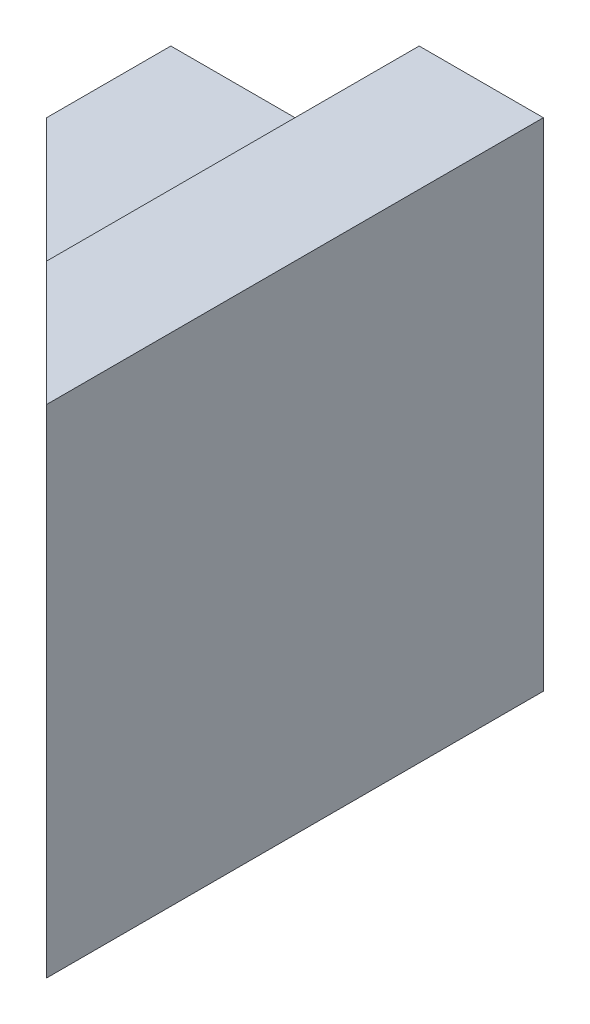
ISO-10303-21;
HEADER;
FILE_DESCRIPTION(('STEP AP214'),'2;1');
FILE_NAME('part.step','',(''),(''),'','','');
FILE_SCHEMA(('AUTOMOTIVE_DESIGN { 1 0 10303 214 1 1 1 1 }'));
ENDSEC;
DATA;
#1=APPLICATION_CONTEXT('core data for automotive mechanical design processes');
#2=APPLICATION_PROTOCOL_DEFINITION('international standard','automotive_design',2000,#1);
#3=PRODUCT_CONTEXT('',#1,'mechanical');
#4=PRODUCT('Part','Part','',(#3));
#5=PRODUCT_RELATED_PRODUCT_CATEGORY('part','',(#4));
#6=PRODUCT_DEFINITION_FORMATION('','',#4);
#7=PRODUCT_DEFINITION_CONTEXT('part definition',#1,'design');
#8=PRODUCT_DEFINITION('design','',#6,#7);
#9=PRODUCT_DEFINITION_SHAPE('','',#8);
#10=(LENGTH_UNIT() NAMED_UNIT(*) SI_UNIT(.MILLI.,.METRE.));
#11=(NAMED_UNIT(*) PLANE_ANGLE_UNIT() SI_UNIT($,.RADIAN.));
#12=(NAMED_UNIT(*) SI_UNIT($,.STERADIAN.) SOLID_ANGLE_UNIT());
#13=UNCERTAINTY_MEASURE_WITH_UNIT(LENGTH_MEASURE(1.E-05),#10,'distance_accuracy_value','');
#14=(GEOMETRIC_REPRESENTATION_CONTEXT(3) GLOBAL_UNCERTAINTY_ASSIGNED_CONTEXT((#13)) GLOBAL_UNIT_ASSIGNED_CONTEXT((#10,
#11,#12)) REPRESENTATION_CONTEXT('',''));
#15=CARTESIAN_POINT('',(0.,0.,0.));
#16=DIRECTION('',(0.,0.,1.));
#17=DIRECTION('',(1.,0.,0.));
#18=AXIS2_PLACEMENT_3D('',#15,#16,#17);
#19=CARTESIAN_POINT('',(1.,0.,4.));
#20=DIRECTION('',(0.,1.,0.));
#21=DIRECTION('',(-1.,0.,0.));
#22=AXIS2_PLACEMENT_3D('',#19,#20,#21);
#23=PLANE('',#22);
#24=DIRECTION('',(0.,0.,-1.));
#25=VECTOR('',#24,1.);
#26=CARTESIAN_POINT('',(1.,0.,4.));
#27=LINE('',#26,#25);
#28=CARTESIAN_POINT('',(1.,0.,1.));
#29=VERTEX_POINT('',#28);
#30=CARTESIAN_POINT('',(1.,0.,0.));
#31=VERTEX_POINT('',#30);
#32=EDGE_CURVE('E11',#29,#31,#27,.T.);
#33=ORIENTED_EDGE('',*,*,#32,.F.);
#34=DIRECTION('',(-0.707106781186548,0.,-0.707106781186548));
#35=VECTOR('',#34,1.);
#36=CARTESIAN_POINT('',(2.5,0.,2.5));
#37=LINE('',#36,#35);
#38=CARTESIAN_POINT('',(0.,0.,0.));
#39=VERTEX_POINT('',#38);
#40=EDGE_CURVE('E225',#29,#39,#37,.T.);
#41=ORIENTED_EDGE('',*,*,#40,.T.);
#42=DIRECTION('',(1.,0.,0.));
#43=VECTOR('',#42,1.);
#44=CARTESIAN_POINT('',(1.,0.,0.));
#45=LINE('',#44,#43);
#46=EDGE_CURVE('E167',#39,#31,#45,.T.);
#47=ORIENTED_EDGE('',*,*,#46,.T.);
#48=EDGE_LOOP('',(#33,#41,#47));
#49=FACE_BOUND('',#48,.T.);
#50=ADVANCED_FACE('F33',(#49),#23,.F.);
#51=CARTESIAN_POINT('',(1.,1.,4.));
#52=DIRECTION('',(-1.,0.,0.));
#53=DIRECTION('',(0.,0.,1.));
#54=AXIS2_PLACEMENT_3D('',#51,#52,#53);
#55=PLANE('',#54);
#56=DIRECTION('',(0.,0.,-1.));
#57=VECTOR('',#56,1.);
#58=CARTESIAN_POINT('',(1.,1.,4.));
#59=LINE('',#58,#57);
#60=CARTESIAN_POINT('',(1.,1.,1.));
#61=VERTEX_POINT('',#60);
#62=CARTESIAN_POINT('',(1.,1.,0.));
#63=VERTEX_POINT('',#62);
#64=EDGE_CURVE('E40',#61,#63,#59,.T.);
#65=ORIENTED_EDGE('',*,*,#64,.F.);
#66=DIRECTION('',(0.,-1.,0.));
#67=VECTOR('',#66,1.);
#68=CARTESIAN_POINT('',(1.,1.,1.));
#69=LINE('',#68,#67);
#70=EDGE_CURVE('E223',#61,#29,#69,.T.);
#71=ORIENTED_EDGE('',*,*,#70,.T.);
#72=ORIENTED_EDGE('',*,*,#32,.T.);
#73=DIRECTION('',(0.,1.,0.));
#74=VECTOR('',#73,1.);
#75=CARTESIAN_POINT('',(1.,1.,0.));
#76=LINE('',#75,#74);
#77=EDGE_CURVE('E161',#31,#63,#76,.T.);
#78=ORIENTED_EDGE('',*,*,#77,.T.);
#79=EDGE_LOOP('',(#65,#71,#72,#78));
#80=FACE_BOUND('',#79,.T.);
#81=ADVANCED_FACE('F162',(#80),#55,.F.);
#82=CARTESIAN_POINT('',(3.,1.,4.));
#83=DIRECTION('',(0.,1.,0.));
#84=DIRECTION('',(-1.,0.,0.));
#85=AXIS2_PLACEMENT_3D('',#82,#83,#84);
#86=PLANE('',#85);
#87=DIRECTION('',(0.,0.,-1.));
#88=VECTOR('',#87,1.);
#89=CARTESIAN_POINT('',(3.,1.,4.));
#90=LINE('',#89,#88);
#91=CARTESIAN_POINT('',(3.,1.,3.));
#92=VERTEX_POINT('',#91);
#93=CARTESIAN_POINT('',(3.,1.,0.));
#94=VERTEX_POINT('',#93);
#95=EDGE_CURVE('E146',#92,#94,#90,.T.);
#96=ORIENTED_EDGE('',*,*,#95,.F.);
#97=DIRECTION('',(-0.707106781186548,0.,-0.707106781186548));
#98=VECTOR('',#97,1.);
#99=CARTESIAN_POINT('',(3.5,1.,3.5));
#100=LINE('',#99,#98);
#101=EDGE_CURVE('E157',#92,#61,#100,.T.);
#102=ORIENTED_EDGE('',*,*,#101,.T.);
#103=ORIENTED_EDGE('',*,*,#64,.T.);
#104=DIRECTION('',(1.,0.,0.));
#105=VECTOR('',#104,1.);
#106=CARTESIAN_POINT('',(3.,1.,0.));
#107=LINE('',#106,#105);
#108=EDGE_CURVE('E155',#63,#94,#107,.T.);
#109=ORIENTED_EDGE('',*,*,#108,.T.);
#110=EDGE_LOOP('',(#96,#102,#103,#109));
#111=FACE_BOUND('',#110,.T.);
#112=ADVANCED_FACE('F153',(#111),#86,.F.);
#113=CARTESIAN_POINT('',(3.,0.,4.));
#114=DIRECTION('',(1.,0.,0.));
#115=DIRECTION('',(0.,0.,-1.));
#116=AXIS2_PLACEMENT_3D('',#113,#114,#115);
#117=PLANE('',#116);
#118=DIRECTION('',(0.,0.,-1.));
#119=VECTOR('',#118,1.);
#120=CARTESIAN_POINT('',(3.,0.,4.));
#121=LINE('',#120,#119);
#122=CARTESIAN_POINT('',(3.,0.,3.));
#123=VERTEX_POINT('',#122);
#124=CARTESIAN_POINT('',(3.,0.,0.));
#125=VERTEX_POINT('',#124);
#126=EDGE_CURVE('E139',#123,#125,#121,.T.);
#127=ORIENTED_EDGE('',*,*,#126,.F.);
#128=DIRECTION('',(0.,1.,0.));
#129=VECTOR('',#128,1.);
#130=CARTESIAN_POINT('',(3.,0.,3.));
#131=LINE('',#130,#129);
#132=EDGE_CURVE('E219',#123,#92,#131,.T.);
#133=ORIENTED_EDGE('',*,*,#132,.T.);
#134=ORIENTED_EDGE('',*,*,#95,.T.);
#135=DIRECTION('',(0.,-1.,0.));
#136=VECTOR('',#135,1.);
#137=CARTESIAN_POINT('',(3.,0.,0.));
#138=LINE('',#137,#136);
#139=EDGE_CURVE('E172',#94,#125,#138,.T.);
#140=ORIENTED_EDGE('',*,*,#139,.T.);
#141=EDGE_LOOP('',(#127,#133,#134,#140));
#142=FACE_BOUND('',#141,.T.);
#143=ADVANCED_FACE('F230',(#142),#117,.F.);
#144=CARTESIAN_POINT('',(4.,0.,4.));
#145=DIRECTION('',(0.,1.,0.));
#146=DIRECTION('',(-1.,0.,0.));
#147=AXIS2_PLACEMENT_3D('',#144,#145,#146);
#148=PLANE('',#147);
#149=DIRECTION('',(0.,0.,-1.));
#150=VECTOR('',#149,1.);
#151=CARTESIAN_POINT('',(4.,0.,4.));
#152=LINE('',#151,#150);
#153=CARTESIAN_POINT('',(4.,0.,4.));
#154=VERTEX_POINT('',#153);
#155=CARTESIAN_POINT('',(4.,0.,0.));
#156=VERTEX_POINT('',#155);
#157=EDGE_CURVE('E137',#154,#156,#152,.T.);
#158=ORIENTED_EDGE('',*,*,#157,.F.);
#159=DIRECTION('',(-0.707106781186548,0.,-0.707106781186548));
#160=VECTOR('',#159,1.);
#161=CARTESIAN_POINT('',(4.,0.,4.));
#162=LINE('',#161,#160);
#163=EDGE_CURVE('E118',#154,#123,#162,.T.);
#164=ORIENTED_EDGE('',*,*,#163,.T.);
#165=ORIENTED_EDGE('',*,*,#126,.T.);
#166=DIRECTION('',(1.,0.,0.));
#167=VECTOR('',#166,1.);
#168=CARTESIAN_POINT('',(4.,0.,0.));
#169=LINE('',#168,#167);
#170=EDGE_CURVE('E174',#125,#156,#169,.T.);
#171=ORIENTED_EDGE('',*,*,#170,.T.);
#172=EDGE_LOOP('',(#158,#164,#165,#171));
#173=FACE_BOUND('',#172,.T.);
#174=ADVANCED_FACE('F232',(#173),#148,.F.);
#175=CARTESIAN_POINT('',(4.,4.,4.));
#176=DIRECTION('',(-1.,0.,0.));
#177=DIRECTION('',(0.,-1.,0.));
#178=AXIS2_PLACEMENT_3D('',#175,#176,#177);
#179=PLANE('',#178);
#180=DIRECTION('',(0.,1.,0.));
#181=VECTOR('',#180,1.);
#182=CARTESIAN_POINT('',(4.,4.,0.));
#183=LINE('',#182,#181);
#184=CARTESIAN_POINT('',(4.,4.,0.));
#185=VERTEX_POINT('',#184);
#186=EDGE_CURVE('E136',#156,#185,#183,.T.);
#187=ORIENTED_EDGE('',*,*,#186,.T.);
#188=DIRECTION('',(0.,0.,-1.));
#189=VECTOR('',#188,1.);
#190=CARTESIAN_POINT('',(4.,4.,4.));
#191=LINE('',#190,#189);
#192=CARTESIAN_POINT('',(4.,4.,4.));
#193=VERTEX_POINT('',#192);
#194=EDGE_CURVE('E130',#193,#185,#191,.T.);
#195=ORIENTED_EDGE('',*,*,#194,.F.);
#196=DIRECTION('',(0.,1.,0.));
#197=VECTOR('',#196,1.);
#198=CARTESIAN_POINT('',(4.,4.,4.));
#199=LINE('',#198,#197);
#200=EDGE_CURVE('E112',#154,#193,#199,.T.);
#201=ORIENTED_EDGE('',*,*,#200,.F.);
#202=ORIENTED_EDGE('',*,*,#157,.T.);
#203=EDGE_LOOP('',(#187,#195,#201,#202));
#204=FACE_BOUND('',#203,.T.);
#205=ADVANCED_FACE('F134',(#204),#179,.F.);
#206=CARTESIAN_POINT('',(3.,4.,4.));
#207=DIRECTION('',(0.,-1.,0.));
#208=DIRECTION('',(0.,0.,-1.));
#209=AXIS2_PLACEMENT_3D('',#206,#207,#208);
#210=PLANE('',#209);
#211=DIRECTION('',(0.,0.,-1.));
#212=VECTOR('',#211,1.);
#213=CARTESIAN_POINT('',(3.,4.,4.));
#214=LINE('',#213,#212);
#215=CARTESIAN_POINT('',(3.,4.,3.));
#216=VERTEX_POINT('',#215);
#217=CARTESIAN_POINT('',(3.,4.,0.));
#218=VERTEX_POINT('',#217);
#219=EDGE_CURVE('E132',#216,#218,#214,.T.);
#220=ORIENTED_EDGE('',*,*,#219,.F.);
#221=DIRECTION('',(-0.707106781186548,0.,-0.707106781186548));
#222=VECTOR('',#221,1.);
#223=CARTESIAN_POINT('',(0.,4.,0.));
#224=LINE('',#223,#222);
#225=EDGE_CURVE('E115',#193,#216,#224,.T.);
#226=ORIENTED_EDGE('',*,*,#225,.F.);
#227=ORIENTED_EDGE('',*,*,#194,.T.);
#228=DIRECTION('',(-1.,0.,0.));
#229=VECTOR('',#228,1.);
#230=CARTESIAN_POINT('',(3.,4.,0.));
#231=LINE('',#230,#229);
#232=EDGE_CURVE('E180',#185,#218,#231,.T.);
#233=ORIENTED_EDGE('',*,*,#232,.T.);
#234=EDGE_LOOP('',(#220,#226,#227,#233));
#235=FACE_BOUND('',#234,.T.);
#236=ADVANCED_FACE('F128',(#235),#210,.F.);
#237=CARTESIAN_POINT('',(3.,3.,4.));
#238=DIRECTION('',(1.,0.,0.));
#239=DIRECTION('',(0.,0.,-1.));
#240=AXIS2_PLACEMENT_3D('',#237,#238,#239);
#241=PLANE('',#240);
#242=DIRECTION('',(0.,0.,-1.));
#243=VECTOR('',#242,1.);
#244=CARTESIAN_POINT('',(3.,3.,4.));
#245=LINE('',#244,#243);
#246=CARTESIAN_POINT('',(3.,3.,3.));
#247=VERTEX_POINT('',#246);
#248=CARTESIAN_POINT('',(3.,3.,0.));
#249=VERTEX_POINT('',#248);
#250=EDGE_CURVE('E141',#247,#249,#245,.T.);
#251=ORIENTED_EDGE('',*,*,#250,.F.);
#252=DIRECTION('',(0.,1.,0.));
#253=VECTOR('',#252,1.);
#254=CARTESIAN_POINT('',(3.,3.,3.));
#255=LINE('',#254,#253);
#256=EDGE_CURVE('E213',#247,#216,#255,.T.);
#257=ORIENTED_EDGE('',*,*,#256,.T.);
#258=ORIENTED_EDGE('',*,*,#219,.T.);
#259=DIRECTION('',(0.,-1.,0.));
#260=VECTOR('',#259,1.);
#261=CARTESIAN_POINT('',(3.,3.,0.));
#262=LINE('',#261,#260);
#263=EDGE_CURVE('E182',#218,#249,#262,.T.);
#264=ORIENTED_EDGE('',*,*,#263,.T.);
#265=EDGE_LOOP('',(#251,#257,#258,#264));
#266=FACE_BOUND('',#265,.T.);
#267=ADVANCED_FACE('F205',(#266),#241,.F.);
#268=CARTESIAN_POINT('',(1.,3.,4.));
#269=DIRECTION('',(0.,-1.,0.));
#270=DIRECTION('',(0.,0.,-1.));
#271=AXIS2_PLACEMENT_3D('',#268,#269,#270);
#272=PLANE('',#271);
#273=DIRECTION('',(0.,0.,-1.));
#274=VECTOR('',#273,1.);
#275=CARTESIAN_POINT('',(1.,3.,4.));
#276=LINE('',#275,#274);
#277=CARTESIAN_POINT('',(1.,3.,0.999999999999999));
#278=VERTEX_POINT('',#277);
#279=CARTESIAN_POINT('',(1.,3.,0.));
#280=VERTEX_POINT('',#279);
#281=EDGE_CURVE('E194',#278,#280,#276,.T.);
#282=ORIENTED_EDGE('',*,*,#281,.F.);
#283=DIRECTION('',(0.707106781186548,0.,0.707106781186548));
#284=VECTOR('',#283,1.);
#285=CARTESIAN_POINT('',(2.5,3.,2.5));
#286=LINE('',#285,#284);
#287=EDGE_CURVE('E202',#278,#247,#286,.T.);
#288=ORIENTED_EDGE('',*,*,#287,.T.);
#289=ORIENTED_EDGE('',*,*,#250,.T.);
#290=DIRECTION('',(-1.,0.,0.));
#291=VECTOR('',#290,1.);
#292=CARTESIAN_POINT('',(1.,3.,0.));
#293=LINE('',#292,#291);
#294=EDGE_CURVE('E185',#249,#280,#293,.T.);
#295=ORIENTED_EDGE('',*,*,#294,.T.);
#296=EDGE_LOOP('',(#282,#288,#289,#295));
#297=FACE_BOUND('',#296,.T.);
#298=ADVANCED_FACE('F199',(#297),#272,.F.);
#299=CARTESIAN_POINT('',(1.,2.,4.));
#300=DIRECTION('',(1.,0.,0.));
#301=DIRECTION('',(0.,0.,-1.));
#302=AXIS2_PLACEMENT_3D('',#299,#300,#301);
#303=PLANE('',#302);
#304=DIRECTION('',(0.,0.,-1.));
#305=VECTOR('',#304,1.);
#306=CARTESIAN_POINT('',(1.,2.,4.));
#307=LINE('',#306,#305);
#308=CARTESIAN_POINT('',(1.,2.,1.));
#309=VERTEX_POINT('',#308);
#310=CARTESIAN_POINT('',(1.,2.,0.));
#311=VERTEX_POINT('',#310);
#312=EDGE_CURVE('E53',#309,#311,#307,.T.);
#313=ORIENTED_EDGE('',*,*,#312,.F.);
#314=DIRECTION('',(0.,1.,0.));
#315=VECTOR('',#314,1.);
#316=CARTESIAN_POINT('',(1.,2.,0.999999999999999));
#317=LINE('',#316,#315);
#318=EDGE_CURVE('E211',#309,#278,#317,.T.);
#319=ORIENTED_EDGE('',*,*,#318,.T.);
#320=ORIENTED_EDGE('',*,*,#281,.T.);
#321=DIRECTION('',(0.,-1.,0.));
#322=VECTOR('',#321,1.);
#323=CARTESIAN_POINT('',(1.,2.,0.));
#324=LINE('',#323,#322);
#325=EDGE_CURVE('E188',#280,#311,#324,.T.);
#326=ORIENTED_EDGE('',*,*,#325,.T.);
#327=EDGE_LOOP('',(#313,#319,#320,#326));
#328=FACE_BOUND('',#327,.T.);
#329=ADVANCED_FACE('F209',(#328),#303,.F.);
#330=CARTESIAN_POINT('',(0.,2.,4.));
#331=DIRECTION('',(0.,-1.,0.));
#332=DIRECTION('',(1.,0.,0.));
#333=AXIS2_PLACEMENT_3D('',#330,#331,#332);
#334=PLANE('',#333);
#335=DIRECTION('',(-1.,0.,0.));
#336=VECTOR('',#335,1.);
#337=CARTESIAN_POINT('',(0.,2.,0.));
#338=LINE('',#337,#336);
#339=CARTESIAN_POINT('',(0.,2.,0.));
#340=VERTEX_POINT('',#339);
#341=EDGE_CURVE('E190',#311,#340,#338,.T.);
#342=ORIENTED_EDGE('',*,*,#341,.T.);
#343=DIRECTION('',(0.707106781186548,0.,0.707106781186548));
#344=VECTOR('',#343,1.);
#345=CARTESIAN_POINT('',(2.,2.,2.));
#346=LINE('',#345,#344);
#347=EDGE_CURVE('E47',#340,#309,#346,.T.);
#348=ORIENTED_EDGE('',*,*,#347,.T.);
#349=ORIENTED_EDGE('',*,*,#312,.T.);
#350=EDGE_LOOP('',(#342,#348,#349));
#351=FACE_BOUND('',#350,.T.);
#352=ADVANCED_FACE('F298',(#351),#334,.F.);
#353=CARTESIAN_POINT('',(0.,0.,0.));
#354=DIRECTION('',(0.,0.,-1.));
#355=DIRECTION('',(-1.,0.,0.));
#356=AXIS2_PLACEMENT_3D('',#353,#354,#355);
#357=PLANE('',#356);
#358=ORIENTED_EDGE('',*,*,#46,.F.);
#359=DIRECTION('',(0.,-1.,0.));
#360=VECTOR('',#359,1.);
#361=CARTESIAN_POINT('',(0.,0.,0.));
#362=LINE('',#361,#360);
#363=EDGE_CURVE('E123',#340,#39,#362,.T.);
#364=ORIENTED_EDGE('',*,*,#363,.F.);
#365=ORIENTED_EDGE('',*,*,#341,.F.);
#366=ORIENTED_EDGE('',*,*,#325,.F.);
#367=ORIENTED_EDGE('',*,*,#294,.F.);
#368=ORIENTED_EDGE('',*,*,#263,.F.);
#369=ORIENTED_EDGE('',*,*,#232,.F.);
#370=ORIENTED_EDGE('',*,*,#186,.F.);
#371=ORIENTED_EDGE('',*,*,#170,.F.);
#372=ORIENTED_EDGE('',*,*,#139,.F.);
#373=ORIENTED_EDGE('',*,*,#108,.F.);
#374=ORIENTED_EDGE('',*,*,#77,.F.);
#375=EDGE_LOOP('',(#358,#364,#365,#366,#367,#368,#369,#370,#371,#372,#373,#374));
#376=FACE_BOUND('',#375,.T.);
#377=ADVANCED_FACE('F169',(#376),#357,.T.);
#378=CARTESIAN_POINT('',(0.,-6.,0.));
#379=DIRECTION('',(0.707106781186548,0.,-0.707106781186548));
#380=DIRECTION('',(-0.707106781186548,0.,-0.707106781186548));
#381=AXIS2_PLACEMENT_3D('',#378,#379,#380);
#382=PLANE('',#381);
#383=ORIENTED_EDGE('',*,*,#70,.F.);
#384=ORIENTED_EDGE('',*,*,#101,.F.);
#385=ORIENTED_EDGE('',*,*,#132,.F.);
#386=ORIENTED_EDGE('',*,*,#163,.F.);
#387=ORIENTED_EDGE('',*,*,#200,.T.);
#388=ORIENTED_EDGE('',*,*,#225,.T.);
#389=ORIENTED_EDGE('',*,*,#256,.F.);
#390=ORIENTED_EDGE('',*,*,#287,.F.);
#391=ORIENTED_EDGE('',*,*,#318,.F.);
#392=ORIENTED_EDGE('',*,*,#347,.F.);
#393=ORIENTED_EDGE('',*,*,#363,.T.);
#394=ORIENTED_EDGE('',*,*,#40,.F.);
#395=EDGE_LOOP('',(#383,#384,#385,#386,#387,#388,#389,#390,#391,#392,#393,#394));
#396=FACE_BOUND('',#395,.T.);
#397=ADVANCED_FACE('F114',(#396),#382,.F.);
#398=CLOSED_SHELL('',(#50,#81,#112,#143,#174,#205,#236,#267,#298,#329,#352,#377,#397));
#399=MANIFOLD_SOLID_BREP('B2',#398);
#400=ADVANCED_BREP_SHAPE_REPRESENTATION('',(#18,#399),#14);
#401=SHAPE_DEFINITION_REPRESENTATION(#9,#400);
ENDSEC;
END-ISO-10303-21;
